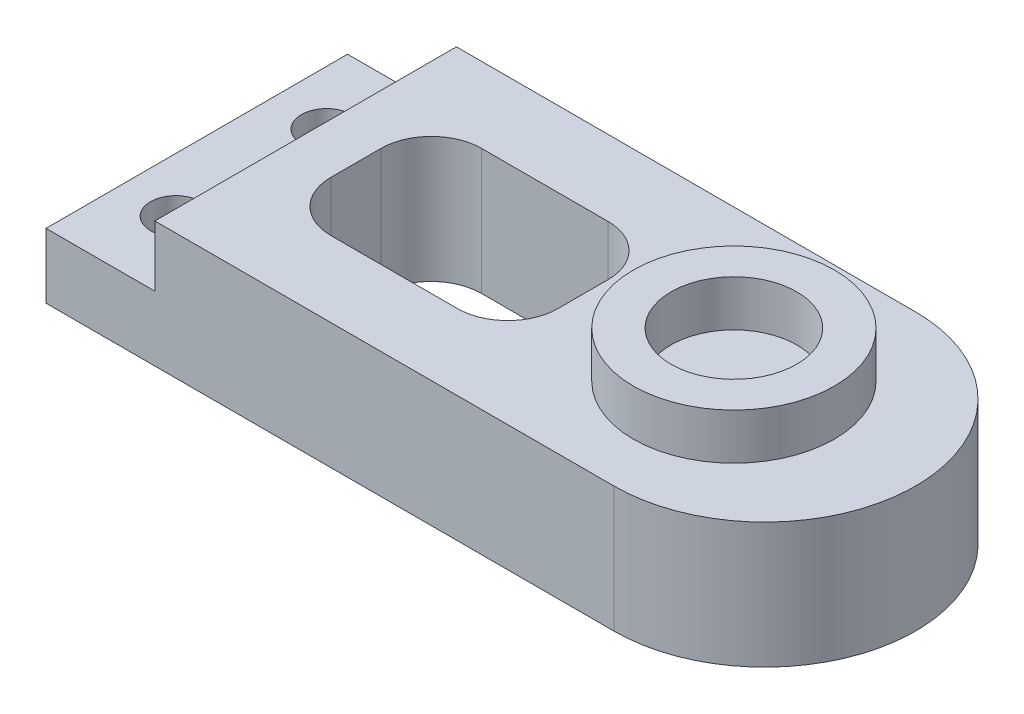
ISO-10303-21;
HEADER;
FILE_DESCRIPTION(('STEP AP214'),'2;1');
FILE_NAME('part.step','',(''),(''),'','','');
FILE_SCHEMA(('AUTOMOTIVE_DESIGN { 1 0 10303 214 1 1 1 1 }'));
ENDSEC;
DATA;
#1=APPLICATION_CONTEXT('core data for automotive mechanical design processes');
#2=APPLICATION_PROTOCOL_DEFINITION('international standard','automotive_design',2000,#1);
#3=PRODUCT_CONTEXT('',#1,'mechanical');
#4=PRODUCT('Part','Part','',(#3));
#5=PRODUCT_RELATED_PRODUCT_CATEGORY('part','',(#4));
#6=PRODUCT_DEFINITION_FORMATION('','',#4);
#7=PRODUCT_DEFINITION_CONTEXT('part definition',#1,'design');
#8=PRODUCT_DEFINITION('design','',#6,#7);
#9=PRODUCT_DEFINITION_SHAPE('','',#8);
#10=(LENGTH_UNIT() NAMED_UNIT(*) SI_UNIT(.MILLI.,.METRE.));
#11=(NAMED_UNIT(*) PLANE_ANGLE_UNIT() SI_UNIT($,.RADIAN.));
#12=(NAMED_UNIT(*) SI_UNIT($,.STERADIAN.) SOLID_ANGLE_UNIT());
#13=UNCERTAINTY_MEASURE_WITH_UNIT(LENGTH_MEASURE(1.E-05),#10,'distance_accuracy_value','');
#14=(GEOMETRIC_REPRESENTATION_CONTEXT(3) GLOBAL_UNCERTAINTY_ASSIGNED_CONTEXT((#13)) GLOBAL_UNIT_ASSIGNED_CONTEXT((#10,
#11,#12)) REPRESENTATION_CONTEXT('',''));
#15=CARTESIAN_POINT('',(0.,0.,0.));
#16=DIRECTION('',(0.,0.,1.));
#17=DIRECTION('',(1.,0.,0.));
#18=AXIS2_PLACEMENT_3D('',#15,#16,#17);
#19=CARTESIAN_POINT('',(0.,5.,0.));
#20=DIRECTION('',(1.,0.,0.));
#21=DIRECTION('',(0.,0.,-1.));
#22=AXIS2_PLACEMENT_3D('',#19,#20,#21);
#23=PLANE('',#22);
#24=DIRECTION('',(0.,0.,1.));
#25=VECTOR('',#24,1.);
#26=CARTESIAN_POINT('',(0.,2.58,-12.));
#27=LINE('',#26,#25);
#28=CARTESIAN_POINT('',(0.,2.58,-12.));
#29=VERTEX_POINT('',#28);
#30=CARTESIAN_POINT('',(0.,2.58,0.));
#31=VERTEX_POINT('',#30);
#32=EDGE_CURVE('E223',#29,#31,#27,.T.);
#33=ORIENTED_EDGE('',*,*,#32,.F.);
#34=DIRECTION('',(0.,-1.,0.));
#35=VECTOR('',#34,1.);
#36=CARTESIAN_POINT('',(0.,5.,-12.));
#37=LINE('',#36,#35);
#38=CARTESIAN_POINT('',(0.,0.,-12.));
#39=VERTEX_POINT('',#38);
#40=EDGE_CURVE('E248',#29,#39,#37,.T.);
#41=ORIENTED_EDGE('',*,*,#40,.T.);
#42=DIRECTION('',(0.,0.,1.));
#43=VECTOR('',#42,1.);
#44=CARTESIAN_POINT('',(0.,0.,0.));
#45=LINE('',#44,#43);
#46=CARTESIAN_POINT('',(0.,0.,0.));
#47=VERTEX_POINT('',#46);
#48=EDGE_CURVE('E238',#39,#47,#45,.T.);
#49=ORIENTED_EDGE('',*,*,#48,.T.);
#50=DIRECTION('',(0.,-1.,0.));
#51=VECTOR('',#50,1.);
#52=CARTESIAN_POINT('',(0.,5.,0.));
#53=LINE('',#52,#51);
#54=EDGE_CURVE('E35',#31,#47,#53,.T.);
#55=ORIENTED_EDGE('',*,*,#54,.F.);
#56=EDGE_LOOP('',(#33,#41,#49,#55));
#57=FACE_BOUND('',#56,.T.);
#58=ADVANCED_FACE('F32',(#57),#23,.F.);
#59=CARTESIAN_POINT('',(0.,5.,0.));
#60=DIRECTION('',(0.,0.,-1.));
#61=DIRECTION('',(-1.,0.,0.));
#62=AXIS2_PLACEMENT_3D('',#59,#60,#61);
#63=PLANE('',#62);
#64=DIRECTION('',(1.,0.,0.));
#65=VECTOR('',#64,1.);
#66=CARTESIAN_POINT('',(0.,5.,0.));
#67=LINE('',#66,#65);
#68=CARTESIAN_POINT('',(4.33,5.,0.));
#69=VERTEX_POINT('',#68);
#70=CARTESIAN_POINT('',(22.6,5.,0.));
#71=VERTEX_POINT('',#70);
#72=EDGE_CURVE('E240',#69,#71,#67,.T.);
#73=ORIENTED_EDGE('',*,*,#72,.F.);
#74=DIRECTION('',(0.,1.,0.));
#75=VECTOR('',#74,1.);
#76=CARTESIAN_POINT('',(4.33,2.58,0.));
#77=LINE('',#76,#75);
#78=CARTESIAN_POINT('',(4.33,2.58,0.));
#79=VERTEX_POINT('',#78);
#80=EDGE_CURVE('E233',#79,#69,#77,.T.);
#81=ORIENTED_EDGE('',*,*,#80,.F.);
#82=DIRECTION('',(1.,0.,0.));
#83=VECTOR('',#82,1.);
#84=CARTESIAN_POINT('',(0.,2.58,0.));
#85=LINE('',#84,#83);
#86=EDGE_CURVE('E225',#31,#79,#85,.T.);
#87=ORIENTED_EDGE('',*,*,#86,.F.);
#88=ORIENTED_EDGE('',*,*,#54,.T.);
#89=DIRECTION('',(1.,0.,0.));
#90=VECTOR('',#89,1.);
#91=CARTESIAN_POINT('',(0.,0.,0.));
#92=LINE('',#91,#90);
#93=CARTESIAN_POINT('',(22.6,0.,0.));
#94=VERTEX_POINT('',#93);
#95=EDGE_CURVE('E251',#47,#94,#92,.T.);
#96=ORIENTED_EDGE('',*,*,#95,.T.);
#97=DIRECTION('',(0.,-1.,0.));
#98=VECTOR('',#97,1.);
#99=CARTESIAN_POINT('',(22.6,5.,0.));
#100=LINE('',#99,#98);
#101=EDGE_CURVE('E260',#71,#94,#100,.T.);
#102=ORIENTED_EDGE('',*,*,#101,.F.);
#103=EDGE_LOOP('',(#73,#81,#87,#88,#96,#102));
#104=FACE_BOUND('',#103,.T.);
#105=ADVANCED_FACE('F271',(#104),#63,.F.);
#106=CARTESIAN_POINT('',(22.6,5.,-6.));
#107=DIRECTION('',(0.,-1.,0.));
#108=DIRECTION('',(0.,0.,-1.));
#109=AXIS2_PLACEMENT_3D('',#106,#107,#108);
#110=CYLINDRICAL_SURFACE('',#109,6.);
#111=CARTESIAN_POINT('',(22.6,0.,-6.));
#112=DIRECTION('',(0.,1.,0.));
#113=DIRECTION('',(0.,0.,1.));
#114=AXIS2_PLACEMENT_3D('',#111,#112,#113);
#115=CIRCLE('',#114,6.);
#116=CARTESIAN_POINT('',(22.6,0.,-12.));
#117=VERTEX_POINT('',#116);
#118=EDGE_CURVE('E253',#94,#117,#115,.T.);
#119=ORIENTED_EDGE('',*,*,#118,.T.);
#120=DIRECTION('',(0.,-1.,0.));
#121=VECTOR('',#120,1.);
#122=CARTESIAN_POINT('',(22.6,5.,-12.));
#123=LINE('',#122,#121);
#124=CARTESIAN_POINT('',(22.6,5.,-12.));
#125=VERTEX_POINT('',#124);
#126=EDGE_CURVE('E258',#125,#117,#123,.T.);
#127=ORIENTED_EDGE('',*,*,#126,.F.);
#128=CARTESIAN_POINT('',(22.6,5.,-6.));
#129=DIRECTION('',(0.,1.,0.));
#130=DIRECTION('',(0.,0.,1.));
#131=AXIS2_PLACEMENT_3D('',#128,#129,#130);
#132=CIRCLE('',#131,6.);
#133=EDGE_CURVE('E242',#71,#125,#132,.T.);
#134=ORIENTED_EDGE('',*,*,#133,.F.);
#135=ORIENTED_EDGE('',*,*,#101,.T.);
#136=EDGE_LOOP('',(#119,#127,#134,#135));
#137=FACE_BOUND('',#136,.T.);
#138=ADVANCED_FACE('F284',(#137),#110,.T.);
#139=CARTESIAN_POINT('',(0.,5.,-12.));
#140=DIRECTION('',(0.,0.,1.));
#141=DIRECTION('',(1.,0.,0.));
#142=AXIS2_PLACEMENT_3D('',#139,#140,#141);
#143=PLANE('',#142);
#144=DIRECTION('',(-1.,0.,0.));
#145=VECTOR('',#144,1.);
#146=CARTESIAN_POINT('',(0.,2.58,-12.));
#147=LINE('',#146,#145);
#148=CARTESIAN_POINT('',(4.33,2.58,-12.));
#149=VERTEX_POINT('',#148);
#150=EDGE_CURVE('E231',#149,#29,#147,.T.);
#151=ORIENTED_EDGE('',*,*,#150,.F.);
#152=DIRECTION('',(0.,1.,0.));
#153=VECTOR('',#152,1.);
#154=CARTESIAN_POINT('',(4.33,2.58,-12.));
#155=LINE('',#154,#153);
#156=CARTESIAN_POINT('',(4.33,5.,-12.));
#157=VERTEX_POINT('',#156);
#158=EDGE_CURVE('E235',#149,#157,#155,.T.);
#159=ORIENTED_EDGE('',*,*,#158,.T.);
#160=DIRECTION('',(-1.,0.,0.));
#161=VECTOR('',#160,1.);
#162=CARTESIAN_POINT('',(0.,5.,-12.));
#163=LINE('',#162,#161);
#164=EDGE_CURVE('E245',#125,#157,#163,.T.);
#165=ORIENTED_EDGE('',*,*,#164,.F.);
#166=ORIENTED_EDGE('',*,*,#126,.T.);
#167=DIRECTION('',(-1.,0.,0.));
#168=VECTOR('',#167,1.);
#169=CARTESIAN_POINT('',(0.,0.,-12.));
#170=LINE('',#169,#168);
#171=EDGE_CURVE('E243',#117,#39,#170,.T.);
#172=ORIENTED_EDGE('',*,*,#171,.T.);
#173=ORIENTED_EDGE('',*,*,#40,.F.);
#174=EDGE_LOOP('',(#151,#159,#165,#166,#172,#173));
#175=FACE_BOUND('',#174,.T.);
#176=ADVANCED_FACE('F281',(#175),#143,.F.);
#177=CARTESIAN_POINT('',(22.6,5.,-6.));
#178=DIRECTION('',(0.,1.,0.));
#179=DIRECTION('',(0.,0.,1.));
#180=AXIS2_PLACEMENT_3D('',#177,#178,#179);
#181=PLANE('',#180);
#182=CARTESIAN_POINT('',(13.37,5.,-7.));
#183=DIRECTION('',(0.,1.,0.));
#184=DIRECTION('',(0.,0.,1.));
#185=AXIS2_PLACEMENT_3D('',#182,#183,#184);
#186=CIRCLE('',#185,2.);
#187=CARTESIAN_POINT('',(15.37,5.,-7.));
#188=VERTEX_POINT('',#187);
#189=CARTESIAN_POINT('',(13.37,5.,-9.));
#190=VERTEX_POINT('',#189);
#191=EDGE_CURVE('E47',#188,#190,#186,.T.);
#192=ORIENTED_EDGE('',*,*,#191,.F.);
#193=DIRECTION('',(0.,0.,-1.));
#194=VECTOR('',#193,1.);
#195=CARTESIAN_POINT('',(15.37,5.,-7.));
#196=LINE('',#195,#194);
#197=CARTESIAN_POINT('',(15.37,5.,-5.));
#198=VERTEX_POINT('',#197);
#199=EDGE_CURVE('E152',#198,#188,#196,.T.);
#200=ORIENTED_EDGE('',*,*,#199,.F.);
#201=CARTESIAN_POINT('',(13.37,5.,-5.));
#202=DIRECTION('',(0.,1.,0.));
#203=DIRECTION('',(0.,0.,-1.));
#204=AXIS2_PLACEMENT_3D('',#201,#202,#203);
#205=CIRCLE('',#204,2.);
#206=CARTESIAN_POINT('',(13.37,5.,-3.));
#207=VERTEX_POINT('',#206);
#208=EDGE_CURVE('E155',#207,#198,#205,.T.);
#209=ORIENTED_EDGE('',*,*,#208,.F.);
#210=DIRECTION('',(1.,0.,0.));
#211=VECTOR('',#210,1.);
#212=CARTESIAN_POINT('',(8.33,5.,-3.));
#213=LINE('',#212,#211);
#214=CARTESIAN_POINT('',(8.33,5.,-3.));
#215=VERTEX_POINT('',#214);
#216=EDGE_CURVE('E183',#215,#207,#213,.T.);
#217=ORIENTED_EDGE('',*,*,#216,.F.);
#218=CARTESIAN_POINT('',(8.33,5.,-5.));
#219=DIRECTION('',(0.,1.,0.));
#220=DIRECTION('',(0.,0.,-1.));
#221=AXIS2_PLACEMENT_3D('',#218,#219,#220);
#222=CIRCLE('',#221,2.);
#223=CARTESIAN_POINT('',(6.33,5.,-5.));
#224=VERTEX_POINT('',#223);
#225=EDGE_CURVE('E180',#224,#215,#222,.T.);
#226=ORIENTED_EDGE('',*,*,#225,.F.);
#227=DIRECTION('',(0.,0.,1.));
#228=VECTOR('',#227,1.);
#229=CARTESIAN_POINT('',(6.33,5.,-7.));
#230=LINE('',#229,#228);
#231=CARTESIAN_POINT('',(6.33,5.,-7.));
#232=VERTEX_POINT('',#231);
#233=EDGE_CURVE('E177',#232,#224,#230,.T.);
#234=ORIENTED_EDGE('',*,*,#233,.F.);
#235=CARTESIAN_POINT('',(8.33,5.,-7.));
#236=DIRECTION('',(0.,1.,0.));
#237=DIRECTION('',(0.,0.,1.));
#238=AXIS2_PLACEMENT_3D('',#235,#236,#237);
#239=CIRCLE('',#238,2.);
#240=CARTESIAN_POINT('',(8.33,5.,-9.));
#241=VERTEX_POINT('',#240);
#242=EDGE_CURVE('E174',#241,#232,#239,.T.);
#243=ORIENTED_EDGE('',*,*,#242,.F.);
#244=DIRECTION('',(-1.,0.,0.));
#245=VECTOR('',#244,1.);
#246=CARTESIAN_POINT('',(8.33,5.,-9.));
#247=LINE('',#246,#245);
#248=EDGE_CURVE('E172',#190,#241,#247,.T.);
#249=ORIENTED_EDGE('',*,*,#248,.F.);
#250=EDGE_LOOP('',(#192,#200,#209,#217,#226,#234,#243,#249));
#251=FACE_BOUND('',#250,.T.);
#252=CARTESIAN_POINT('',(21.37,5.,-6.));
#253=DIRECTION('',(0.,1.,0.));
#254=DIRECTION('',(0.,0.,1.));
#255=AXIS2_PLACEMENT_3D('',#252,#253,#254);
#256=CIRCLE('',#255,4.);
#257=CARTESIAN_POINT('',(21.37,5.,-2.));
#258=VERTEX_POINT('',#257);
#259=EDGE_CURVE('E11',#258,#258,#256,.T.);
#260=ORIENTED_EDGE('',*,*,#259,.F.);
#261=EDGE_LOOP('',(#260));
#262=FACE_BOUND('',#261,.T.);
#263=DIRECTION('',(0.,0.,-1.));
#264=VECTOR('',#263,1.);
#265=CARTESIAN_POINT('',(4.33,5.,-12.));
#266=LINE('',#265,#264);
#267=EDGE_CURVE('E214',#69,#157,#266,.T.);
#268=ORIENTED_EDGE('',*,*,#267,.F.);
#269=ORIENTED_EDGE('',*,*,#72,.T.);
#270=ORIENTED_EDGE('',*,*,#133,.T.);
#271=ORIENTED_EDGE('',*,*,#164,.T.);
#272=EDGE_LOOP('',(#268,#269,#270,#271));
#273=FACE_BOUND('',#272,.T.);
#274=ADVANCED_FACE('F287',(#251,#262,#273),#181,.T.);
#275=CARTESIAN_POINT('',(22.6,0.,-6.));
#276=DIRECTION('',(0.,1.,0.));
#277=DIRECTION('',(0.,0.,1.));
#278=AXIS2_PLACEMENT_3D('',#275,#276,#277);
#279=PLANE('',#278);
#280=DIRECTION('',(0.,0.,-1.));
#281=VECTOR('',#280,1.);
#282=CARTESIAN_POINT('',(15.37,0.,-7.));
#283=LINE('',#282,#281);
#284=CARTESIAN_POINT('',(15.37,0.,-5.));
#285=VERTEX_POINT('',#284);
#286=CARTESIAN_POINT('',(15.37,0.,-7.));
#287=VERTEX_POINT('',#286);
#288=EDGE_CURVE('E141',#285,#287,#283,.T.);
#289=ORIENTED_EDGE('',*,*,#288,.T.);
#290=CARTESIAN_POINT('',(13.37,0.,-7.));
#291=DIRECTION('',(0.,1.,0.));
#292=DIRECTION('',(0.,0.,1.));
#293=AXIS2_PLACEMENT_3D('',#290,#291,#292);
#294=CIRCLE('',#293,2.);
#295=CARTESIAN_POINT('',(13.37,0.,-9.));
#296=VERTEX_POINT('',#295);
#297=EDGE_CURVE('E135',#287,#296,#294,.T.);
#298=ORIENTED_EDGE('',*,*,#297,.T.);
#299=DIRECTION('',(-1.,0.,0.));
#300=VECTOR('',#299,1.);
#301=CARTESIAN_POINT('',(8.33,0.,-9.));
#302=LINE('',#301,#300);
#303=CARTESIAN_POINT('',(8.33,0.,-9.));
#304=VERTEX_POINT('',#303);
#305=EDGE_CURVE('E144',#296,#304,#302,.T.);
#306=ORIENTED_EDGE('',*,*,#305,.T.);
#307=CARTESIAN_POINT('',(8.33,0.,-7.));
#308=DIRECTION('',(0.,1.,0.));
#309=DIRECTION('',(0.,0.,1.));
#310=AXIS2_PLACEMENT_3D('',#307,#308,#309);
#311=CIRCLE('',#310,2.);
#312=CARTESIAN_POINT('',(6.33,0.,-7.));
#313=VERTEX_POINT('',#312);
#314=EDGE_CURVE('E55',#304,#313,#311,.T.);
#315=ORIENTED_EDGE('',*,*,#314,.T.);
#316=DIRECTION('',(0.,0.,1.));
#317=VECTOR('',#316,1.);
#318=CARTESIAN_POINT('',(6.33,0.,-7.));
#319=LINE('',#318,#317);
#320=CARTESIAN_POINT('',(6.33,0.,-5.));
#321=VERTEX_POINT('',#320);
#322=EDGE_CURVE('E159',#313,#321,#319,.T.);
#323=ORIENTED_EDGE('',*,*,#322,.T.);
#324=CARTESIAN_POINT('',(8.33,0.,-5.));
#325=DIRECTION('',(0.,1.,0.));
#326=DIRECTION('',(0.,0.,-1.));
#327=AXIS2_PLACEMENT_3D('',#324,#325,#326);
#328=CIRCLE('',#327,2.);
#329=CARTESIAN_POINT('',(8.33,0.,-3.));
#330=VERTEX_POINT('',#329);
#331=EDGE_CURVE('E162',#321,#330,#328,.T.);
#332=ORIENTED_EDGE('',*,*,#331,.T.);
#333=DIRECTION('',(1.,0.,0.));
#334=VECTOR('',#333,1.);
#335=CARTESIAN_POINT('',(8.33,0.,-3.));
#336=LINE('',#335,#334);
#337=CARTESIAN_POINT('',(13.37,0.,-3.));
#338=VERTEX_POINT('',#337);
#339=EDGE_CURVE('E165',#330,#338,#336,.T.);
#340=ORIENTED_EDGE('',*,*,#339,.T.);
#341=CARTESIAN_POINT('',(13.37,0.,-5.));
#342=DIRECTION('',(0.,1.,0.));
#343=DIRECTION('',(0.,0.,-1.));
#344=AXIS2_PLACEMENT_3D('',#341,#342,#343);
#345=CIRCLE('',#344,2.);
#346=EDGE_CURVE('E168',#338,#285,#345,.T.);
#347=ORIENTED_EDGE('',*,*,#346,.T.);
#348=EDGE_LOOP('',(#289,#298,#306,#315,#323,#332,#340,#347));
#349=FACE_BOUND('',#348,.T.);
#350=CARTESIAN_POINT('',(2.16,0.,-9.));
#351=DIRECTION('',(0.,1.,0.));
#352=DIRECTION('',(0.,0.,1.));
#353=AXIS2_PLACEMENT_3D('',#350,#351,#352);
#354=CIRCLE('',#353,1.);
#355=CARTESIAN_POINT('',(2.16,0.,-8.));
#356=VERTEX_POINT('',#355);
#357=EDGE_CURVE('E211',#356,#356,#354,.T.);
#358=ORIENTED_EDGE('',*,*,#357,.T.);
#359=EDGE_LOOP('',(#358));
#360=FACE_BOUND('',#359,.T.);
#361=CARTESIAN_POINT('',(2.16,0.,-3.));
#362=DIRECTION('',(0.,1.,0.));
#363=DIRECTION('',(0.,0.,1.));
#364=AXIS2_PLACEMENT_3D('',#361,#362,#363);
#365=CIRCLE('',#364,1.);
#366=CARTESIAN_POINT('',(2.16,0.,-2.));
#367=VERTEX_POINT('',#366);
#368=EDGE_CURVE('E218',#367,#367,#365,.T.);
#369=ORIENTED_EDGE('',*,*,#368,.T.);
#370=EDGE_LOOP('',(#369));
#371=FACE_BOUND('',#370,.T.);
#372=ORIENTED_EDGE('',*,*,#48,.F.);
#373=ORIENTED_EDGE('',*,*,#171,.F.);
#374=ORIENTED_EDGE('',*,*,#118,.F.);
#375=ORIENTED_EDGE('',*,*,#95,.F.);
#376=EDGE_LOOP('',(#372,#373,#374,#375));
#377=FACE_BOUND('',#376,.T.);
#378=ADVANCED_FACE('F148',(#349,#360,#371,#377),#279,.F.);
#379=CARTESIAN_POINT('',(4.33,2.58,-12.));
#380=DIRECTION('',(1.,0.,0.));
#381=DIRECTION('',(0.,0.,-1.));
#382=AXIS2_PLACEMENT_3D('',#379,#380,#381);
#383=PLANE('',#382);
#384=ORIENTED_EDGE('',*,*,#267,.T.);
#385=ORIENTED_EDGE('',*,*,#158,.F.);
#386=DIRECTION('',(0.,0.,-1.));
#387=VECTOR('',#386,1.);
#388=CARTESIAN_POINT('',(4.33,2.58,-12.));
#389=LINE('',#388,#387);
#390=EDGE_CURVE('E228',#79,#149,#389,.T.);
#391=ORIENTED_EDGE('',*,*,#390,.F.);
#392=ORIENTED_EDGE('',*,*,#80,.T.);
#393=EDGE_LOOP('',(#384,#385,#391,#392));
#394=FACE_BOUND('',#393,.T.);
#395=ADVANCED_FACE('F289',(#394),#383,.F.);
#396=CARTESIAN_POINT('',(0.,2.58,0.));
#397=DIRECTION('',(0.,1.,0.));
#398=DIRECTION('',(0.,0.,1.));
#399=AXIS2_PLACEMENT_3D('',#396,#397,#398);
#400=PLANE('',#399);
#401=CARTESIAN_POINT('',(2.16,2.58,-9.));
#402=DIRECTION('',(0.,1.,0.));
#403=DIRECTION('',(0.,0.,1.));
#404=AXIS2_PLACEMENT_3D('',#401,#402,#403);
#405=CIRCLE('',#404,1.);
#406=CARTESIAN_POINT('',(2.16,2.58,-8.));
#407=VERTEX_POINT('',#406);
#408=EDGE_CURVE('E215',#407,#407,#405,.T.);
#409=ORIENTED_EDGE('',*,*,#408,.F.);
#410=EDGE_LOOP('',(#409));
#411=FACE_BOUND('',#410,.T.);
#412=CARTESIAN_POINT('',(2.16,2.58,-3.));
#413=DIRECTION('',(0.,1.,0.));
#414=DIRECTION('',(0.,0.,1.));
#415=AXIS2_PLACEMENT_3D('',#412,#413,#414);
#416=CIRCLE('',#415,1.);
#417=CARTESIAN_POINT('',(2.16,2.58,-2.));
#418=VERTEX_POINT('',#417);
#419=EDGE_CURVE('E209',#418,#418,#416,.T.);
#420=ORIENTED_EDGE('',*,*,#419,.F.);
#421=EDGE_LOOP('',(#420));
#422=FACE_BOUND('',#421,.T.);
#423=ORIENTED_EDGE('',*,*,#32,.T.);
#424=ORIENTED_EDGE('',*,*,#86,.T.);
#425=ORIENTED_EDGE('',*,*,#390,.T.);
#426=ORIENTED_EDGE('',*,*,#150,.T.);
#427=EDGE_LOOP('',(#423,#424,#425,#426));
#428=FACE_BOUND('',#427,.T.);
#429=ADVANCED_FACE('F291',(#411,#422,#428),#400,.T.);
#430=CARTESIAN_POINT('',(2.16,0.,-3.));
#431=DIRECTION('',(0.,1.,0.));
#432=DIRECTION('',(0.,0.,1.));
#433=AXIS2_PLACEMENT_3D('',#430,#431,#432);
#434=CYLINDRICAL_SURFACE('',#433,1.);
#435=ORIENTED_EDGE('',*,*,#368,.F.);
#436=EDGE_LOOP('',(#435));
#437=FACE_BOUND('',#436,.T.);
#438=ORIENTED_EDGE('',*,*,#419,.T.);
#439=EDGE_LOOP('',(#438));
#440=FACE_BOUND('',#439,.T.);
#441=ADVANCED_FACE('F293',(#437,#440),#434,.F.);
#442=CARTESIAN_POINT('',(2.16,0.,-9.));
#443=DIRECTION('',(0.,1.,0.));
#444=DIRECTION('',(0.,0.,1.));
#445=AXIS2_PLACEMENT_3D('',#442,#443,#444);
#446=CYLINDRICAL_SURFACE('',#445,1.);
#447=ORIENTED_EDGE('',*,*,#357,.F.);
#448=EDGE_LOOP('',(#447));
#449=FACE_BOUND('',#448,.T.);
#450=ORIENTED_EDGE('',*,*,#408,.T.);
#451=EDGE_LOOP('',(#450));
#452=FACE_BOUND('',#451,.T.);
#453=ADVANCED_FACE('F300',(#449,#452),#446,.F.);
#454=CARTESIAN_POINT('',(21.37,6.83,-6.));
#455=DIRECTION('',(0.,1.,0.));
#456=DIRECTION('',(0.,0.,1.));
#457=AXIS2_PLACEMENT_3D('',#454,#455,#456);
#458=PLANE('',#457);
#459=CARTESIAN_POINT('',(21.37,6.83,-6.));
#460=DIRECTION('',(0.,1.,0.));
#461=DIRECTION('',(0.,0.,1.));
#462=AXIS2_PLACEMENT_3D('',#459,#460,#461);
#463=CIRCLE('',#462,4.);
#464=CARTESIAN_POINT('',(21.37,6.83,-2.));
#465=VERTEX_POINT('',#464);
#466=EDGE_CURVE('E205',#465,#465,#463,.T.);
#467=ORIENTED_EDGE('',*,*,#466,.T.);
#468=EDGE_LOOP('',(#467));
#469=FACE_BOUND('',#468,.T.);
#470=CARTESIAN_POINT('',(21.37,6.83,-6.));
#471=DIRECTION('',(0.,1.,0.));
#472=DIRECTION('',(0.,0.,1.));
#473=AXIS2_PLACEMENT_3D('',#470,#471,#472);
#474=CIRCLE('',#473,2.5);
#475=CARTESIAN_POINT('',(21.37,6.83,-3.5));
#476=VERTEX_POINT('',#475);
#477=EDGE_CURVE('E202',#476,#476,#474,.T.);
#478=ORIENTED_EDGE('',*,*,#477,.F.);
#479=EDGE_LOOP('',(#478));
#480=FACE_BOUND('',#479,.T.);
#481=ADVANCED_FACE('F342',(#469,#480),#458,.T.);
#482=CARTESIAN_POINT('',(21.37,6.83,-6.));
#483=DIRECTION('',(0.,-1.,0.));
#484=DIRECTION('',(0.,0.,-1.));
#485=AXIS2_PLACEMENT_3D('',#482,#483,#484);
#486=CYLINDRICAL_SURFACE('',#485,4.);
#487=ORIENTED_EDGE('',*,*,#466,.F.);
#488=EDGE_LOOP('',(#487));
#489=FACE_BOUND('',#488,.T.);
#490=ORIENTED_EDGE('',*,*,#259,.T.);
#491=EDGE_LOOP('',(#490));
#492=FACE_BOUND('',#491,.T.);
#493=ADVANCED_FACE('F334',(#489,#492),#486,.T.);
#494=CARTESIAN_POINT('',(21.37,6.83,-6.));
#495=DIRECTION('',(0.,-1.,0.));
#496=DIRECTION('',(0.,0.,-1.));
#497=AXIS2_PLACEMENT_3D('',#494,#495,#496);
#498=CYLINDRICAL_SURFACE('',#497,2.5);
#499=ORIENTED_EDGE('',*,*,#477,.T.);
#500=EDGE_LOOP('',(#499));
#501=FACE_BOUND('',#500,.T.);
#502=CARTESIAN_POINT('',(21.37,5.,-6.));
#503=DIRECTION('',(0.,1.,0.));
#504=DIRECTION('',(0.,0.,1.));
#505=AXIS2_PLACEMENT_3D('',#502,#503,#504);
#506=CIRCLE('',#505,2.5);
#507=CARTESIAN_POINT('',(21.37,5.,-3.5));
#508=VERTEX_POINT('',#507);
#509=EDGE_CURVE('E190',#508,#508,#506,.T.);
#510=ORIENTED_EDGE('',*,*,#509,.F.);
#511=EDGE_LOOP('',(#510));
#512=FACE_BOUND('',#511,.T.);
#513=ADVANCED_FACE('F326',(#501,#512),#498,.F.);
#514=ORIENTED_EDGE('',*,*,#509,.T.);
#515=EDGE_LOOP('',(#514));
#516=FACE_BOUND('',#515,.T.);
#517=ADVANCED_FACE('F321',(#516),#181,.T.);
#518=CARTESIAN_POINT('',(13.37,0.,-7.));
#519=DIRECTION('',(0.,1.,0.));
#520=DIRECTION('',(0.,0.,1.));
#521=AXIS2_PLACEMENT_3D('',#518,#519,#520);
#522=CYLINDRICAL_SURFACE('',#521,2.);
#523=ORIENTED_EDGE('',*,*,#191,.T.);
#524=DIRECTION('',(0.,1.,0.));
#525=VECTOR('',#524,1.);
#526=CARTESIAN_POINT('',(13.37,0.,-9.));
#527=LINE('',#526,#525);
#528=EDGE_CURVE('E131',#296,#190,#527,.T.);
#529=ORIENTED_EDGE('',*,*,#528,.F.);
#530=ORIENTED_EDGE('',*,*,#297,.F.);
#531=DIRECTION('',(0.,1.,0.));
#532=VECTOR('',#531,1.);
#533=CARTESIAN_POINT('',(15.37,0.,-7.));
#534=LINE('',#533,#532);
#535=EDGE_CURVE('E188',#287,#188,#534,.T.);
#536=ORIENTED_EDGE('',*,*,#535,.T.);
#537=EDGE_LOOP('',(#523,#529,#530,#536));
#538=FACE_BOUND('',#537,.T.);
#539=ADVANCED_FACE('F133',(#538),#522,.F.);
#540=CARTESIAN_POINT('',(15.37,0.,-7.));
#541=DIRECTION('',(1.,0.,0.));
#542=DIRECTION('',(0.,0.,-1.));
#543=AXIS2_PLACEMENT_3D('',#540,#541,#542);
#544=PLANE('',#543);
#545=ORIENTED_EDGE('',*,*,#199,.T.);
#546=ORIENTED_EDGE('',*,*,#535,.F.);
#547=ORIENTED_EDGE('',*,*,#288,.F.);
#548=DIRECTION('',(0.,1.,0.));
#549=VECTOR('',#548,1.);
#550=CARTESIAN_POINT('',(15.37,0.,-5.));
#551=LINE('',#550,#549);
#552=EDGE_CURVE('E191',#285,#198,#551,.T.);
#553=ORIENTED_EDGE('',*,*,#552,.T.);
#554=EDGE_LOOP('',(#545,#546,#547,#553));
#555=FACE_BOUND('',#554,.T.);
#556=ADVANCED_FACE('F332',(#555),#544,.F.);
#557=CARTESIAN_POINT('',(13.37,0.,-5.));
#558=DIRECTION('',(0.,1.,0.));
#559=DIRECTION('',(0.,0.,1.));
#560=AXIS2_PLACEMENT_3D('',#557,#558,#559);
#561=CYLINDRICAL_SURFACE('',#560,2.);
#562=ORIENTED_EDGE('',*,*,#208,.T.);
#563=ORIENTED_EDGE('',*,*,#552,.F.);
#564=ORIENTED_EDGE('',*,*,#346,.F.);
#565=DIRECTION('',(0.,1.,0.));
#566=VECTOR('',#565,1.);
#567=CARTESIAN_POINT('',(13.37,0.,-3.));
#568=LINE('',#567,#566);
#569=EDGE_CURVE('E193',#338,#207,#568,.T.);
#570=ORIENTED_EDGE('',*,*,#569,.T.);
#571=EDGE_LOOP('',(#562,#563,#564,#570));
#572=FACE_BOUND('',#571,.T.);
#573=ADVANCED_FACE('F405',(#572),#561,.F.);
#574=CARTESIAN_POINT('',(8.33,0.,-3.));
#575=DIRECTION('',(0.,0.,1.));
#576=DIRECTION('',(1.,0.,0.));
#577=AXIS2_PLACEMENT_3D('',#574,#575,#576);
#578=PLANE('',#577);
#579=ORIENTED_EDGE('',*,*,#216,.T.);
#580=ORIENTED_EDGE('',*,*,#569,.F.);
#581=ORIENTED_EDGE('',*,*,#339,.F.);
#582=DIRECTION('',(0.,1.,0.));
#583=VECTOR('',#582,1.);
#584=CARTESIAN_POINT('',(8.33,0.,-3.));
#585=LINE('',#584,#583);
#586=EDGE_CURVE('E195',#330,#215,#585,.T.);
#587=ORIENTED_EDGE('',*,*,#586,.T.);
#588=EDGE_LOOP('',(#579,#580,#581,#587));
#589=FACE_BOUND('',#588,.T.);
#590=ADVANCED_FACE('F415',(#589),#578,.F.);
#591=CARTESIAN_POINT('',(8.33,0.,-5.));
#592=DIRECTION('',(0.,1.,0.));
#593=DIRECTION('',(0.,0.,1.));
#594=AXIS2_PLACEMENT_3D('',#591,#592,#593);
#595=CYLINDRICAL_SURFACE('',#594,2.);
#596=ORIENTED_EDGE('',*,*,#225,.T.);
#597=ORIENTED_EDGE('',*,*,#586,.F.);
#598=ORIENTED_EDGE('',*,*,#331,.F.);
#599=DIRECTION('',(0.,1.,0.));
#600=VECTOR('',#599,1.);
#601=CARTESIAN_POINT('',(6.33,0.,-5.));
#602=LINE('',#601,#600);
#603=EDGE_CURVE('E197',#321,#224,#602,.T.);
#604=ORIENTED_EDGE('',*,*,#603,.T.);
#605=EDGE_LOOP('',(#596,#597,#598,#604));
#606=FACE_BOUND('',#605,.T.);
#607=ADVANCED_FACE('F425',(#606),#595,.F.);
#608=CARTESIAN_POINT('',(6.33,0.,-7.));
#609=DIRECTION('',(-1.,0.,0.));
#610=DIRECTION('',(0.,0.,1.));
#611=AXIS2_PLACEMENT_3D('',#608,#609,#610);
#612=PLANE('',#611);
#613=ORIENTED_EDGE('',*,*,#233,.T.);
#614=ORIENTED_EDGE('',*,*,#603,.F.);
#615=ORIENTED_EDGE('',*,*,#322,.F.);
#616=DIRECTION('',(0.,1.,0.));
#617=VECTOR('',#616,1.);
#618=CARTESIAN_POINT('',(6.33,0.,-7.));
#619=LINE('',#618,#617);
#620=EDGE_CURVE('E199',#313,#232,#619,.T.);
#621=ORIENTED_EDGE('',*,*,#620,.T.);
#622=EDGE_LOOP('',(#613,#614,#615,#621));
#623=FACE_BOUND('',#622,.T.);
#624=ADVANCED_FACE('F435',(#623),#612,.F.);
#625=CARTESIAN_POINT('',(8.33,0.,-7.));
#626=DIRECTION('',(0.,1.,0.));
#627=DIRECTION('',(0.,0.,1.));
#628=AXIS2_PLACEMENT_3D('',#625,#626,#627);
#629=CYLINDRICAL_SURFACE('',#628,2.);
#630=ORIENTED_EDGE('',*,*,#242,.T.);
#631=ORIENTED_EDGE('',*,*,#620,.F.);
#632=ORIENTED_EDGE('',*,*,#314,.F.);
#633=DIRECTION('',(0.,1.,0.));
#634=VECTOR('',#633,1.);
#635=CARTESIAN_POINT('',(8.33,0.,-9.));
#636=LINE('',#635,#634);
#637=EDGE_CURVE('E140',#304,#241,#636,.T.);
#638=ORIENTED_EDGE('',*,*,#637,.T.);
#639=EDGE_LOOP('',(#630,#631,#632,#638));
#640=FACE_BOUND('',#639,.T.);
#641=ADVANCED_FACE('F445',(#640),#629,.F.);
#642=CARTESIAN_POINT('',(8.33,0.,-9.));
#643=DIRECTION('',(0.,0.,-1.));
#644=DIRECTION('',(-1.,0.,0.));
#645=AXIS2_PLACEMENT_3D('',#642,#643,#644);
#646=PLANE('',#645);
#647=ORIENTED_EDGE('',*,*,#248,.T.);
#648=ORIENTED_EDGE('',*,*,#637,.F.);
#649=ORIENTED_EDGE('',*,*,#305,.F.);
#650=ORIENTED_EDGE('',*,*,#528,.T.);
#651=EDGE_LOOP('',(#647,#648,#649,#650));
#652=FACE_BOUND('',#651,.T.);
#653=ADVANCED_FACE('F145',(#652),#646,.F.);
#654=CLOSED_SHELL('',(#58,#105,#138,#176,#274,#378,#395,#429,#441,#453,#481,#493,#513,#517,#539,
#556,#573,#590,#607,#624,#641,#653));
#655=MANIFOLD_SOLID_BREP('B2',#654);
#656=ADVANCED_BREP_SHAPE_REPRESENTATION('',(#18,#655),#14);
#657=SHAPE_DEFINITION_REPRESENTATION(#9,#656);
ENDSEC;
END-ISO-10303-21;
